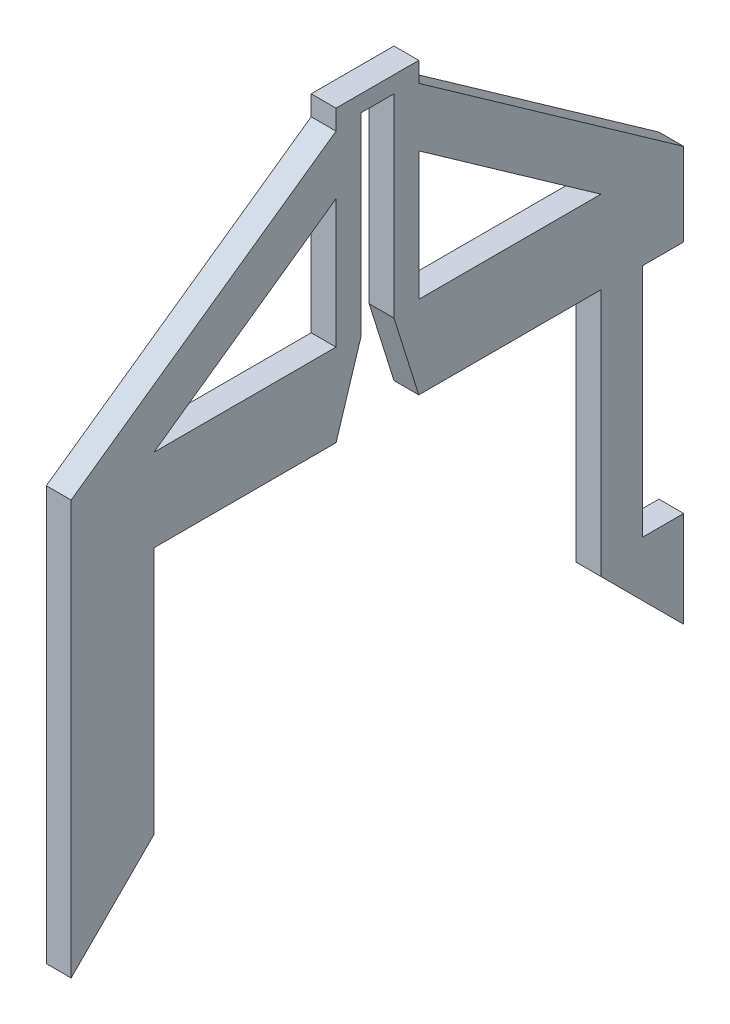
ISO-10303-21;
HEADER;
FILE_DESCRIPTION(('STEP AP214'),'2;1');
FILE_NAME('part.step','',(''),(''),'','','');
FILE_SCHEMA(('AUTOMOTIVE_DESIGN { 1 0 10303 214 1 1 1 1 }'));
ENDSEC;
DATA;
#1=APPLICATION_CONTEXT('core data for automotive mechanical design processes');
#2=APPLICATION_PROTOCOL_DEFINITION('international standard','automotive_design',2000,#1);
#3=PRODUCT_CONTEXT('',#1,'mechanical');
#4=PRODUCT('Part','Part','',(#3));
#5=PRODUCT_RELATED_PRODUCT_CATEGORY('part','',(#4));
#6=PRODUCT_DEFINITION_FORMATION('','',#4);
#7=PRODUCT_DEFINITION_CONTEXT('part definition',#1,'design');
#8=PRODUCT_DEFINITION('design','',#6,#7);
#9=PRODUCT_DEFINITION_SHAPE('','',#8);
#10=(LENGTH_UNIT() NAMED_UNIT(*) SI_UNIT(.MILLI.,.METRE.));
#11=(NAMED_UNIT(*) PLANE_ANGLE_UNIT() SI_UNIT($,.RADIAN.));
#12=(NAMED_UNIT(*) SI_UNIT($,.STERADIAN.) SOLID_ANGLE_UNIT());
#13=UNCERTAINTY_MEASURE_WITH_UNIT(LENGTH_MEASURE(1.E-05),#10,'distance_accuracy_value','');
#14=(GEOMETRIC_REPRESENTATION_CONTEXT(3) GLOBAL_UNCERTAINTY_ASSIGNED_CONTEXT((#13)) GLOBAL_UNIT_ASSIGNED_CONTEXT((#10,
#11,#12)) REPRESENTATION_CONTEXT('',''));
#15=CARTESIAN_POINT('',(0.,0.,0.));
#16=DIRECTION('',(0.,0.,1.));
#17=DIRECTION('',(1.,0.,0.));
#18=AXIS2_PLACEMENT_3D('',#15,#16,#17);
#19=CARTESIAN_POINT('',(3.,37.,-37.));
#20=DIRECTION('',(0.,0.,1.));
#21=DIRECTION('',(0.,-1.,0.));
#22=AXIS2_PLACEMENT_3D('',#19,#20,#21);
#23=PLANE('',#22);
#24=DIRECTION('',(0.,1.,0.));
#25=VECTOR('',#24,1.);
#26=CARTESIAN_POINT('',(0.,37.,-37.));
#27=LINE('',#26,#25);
#28=CARTESIAN_POINT('',(0.,-13.,-37.));
#29=VERTEX_POINT('',#28);
#30=CARTESIAN_POINT('',(0.,-1.4,-37.));
#31=VERTEX_POINT('',#30);
#32=EDGE_CURVE('E521',#29,#31,#27,.T.);
#33=ORIENTED_EDGE('',*,*,#32,.T.);
#34=DIRECTION('',(1.,0.,0.));
#35=VECTOR('',#34,1.);
#36=CARTESIAN_POINT('',(0.,-1.4,-37.));
#37=LINE('',#36,#35);
#38=CARTESIAN_POINT('',(3.,-1.4,-37.));
#39=VERTEX_POINT('',#38);
#40=EDGE_CURVE('E253',#31,#39,#37,.T.);
#41=ORIENTED_EDGE('',*,*,#40,.T.);
#42=DIRECTION('',(0.,1.,0.));
#43=VECTOR('',#42,1.);
#44=CARTESIAN_POINT('',(3.,37.,-37.));
#45=LINE('',#44,#43);
#46=CARTESIAN_POINT('',(3.,-13.,-37.));
#47=VERTEX_POINT('',#46);
#48=EDGE_CURVE('E407',#47,#39,#45,.T.);
#49=ORIENTED_EDGE('',*,*,#48,.F.);
#50=DIRECTION('',(1.,0.,0.));
#51=VECTOR('',#50,1.);
#52=CARTESIAN_POINT('',(-21.9526583780041,-13.,-37.));
#53=LINE('',#52,#51);
#54=EDGE_CURVE('E256',#29,#47,#53,.T.);
#55=ORIENTED_EDGE('',*,*,#54,.F.);
#56=EDGE_LOOP('',(#33,#41,#49,#55));
#57=FACE_BOUND('',#56,.T.);
#58=ADVANCED_FACE('F35',(#57),#23,.F.);
#59=CARTESIAN_POINT('',(3.,0.,0.));
#60=DIRECTION('',(-1.,0.,0.));
#61=DIRECTION('',(0.,0.,1.));
#62=AXIS2_PLACEMENT_3D('',#59,#60,#61);
#63=PLANE('',#62);
#64=DIRECTION('',(0.,0.576742764472841,0.816925812805683));
#65=VECTOR('',#64,1.);
#66=CARTESIAN_POINT('',(3.,37.4138213887072,-26.4138437529685));
#67=LINE('',#66,#65);
#68=CARTESIAN_POINT('',(3.,37.,-27.));
#69=VERTEX_POINT('',#68);
#70=CARTESIAN_POINT('',(3.,52.5318152756431,-4.99999999999998));
#71=VERTEX_POINT('',#70);
#72=EDGE_CURVE('E353',#69,#71,#67,.T.);
#73=ORIENTED_EDGE('',*,*,#72,.F.);
#74=DIRECTION('',(0.,0.,1.));
#75=VECTOR('',#74,1.);
#76=CARTESIAN_POINT('',(3.,37.,-37.));
#77=LINE('',#76,#75);
#78=CARTESIAN_POINT('',(3.,37.,-4.99999999999998));
#79=VERTEX_POINT('',#78);
#80=EDGE_CURVE('E401',#69,#79,#77,.T.);
#81=ORIENTED_EDGE('',*,*,#80,.T.);
#82=DIRECTION('',(0.,1.,0.));
#83=VECTOR('',#82,1.);
#84=CARTESIAN_POINT('',(3.,37.,-4.99999999999998));
#85=LINE('',#84,#83);
#86=EDGE_CURVE('E384',#79,#71,#85,.T.);
#87=ORIENTED_EDGE('',*,*,#86,.T.);
#88=EDGE_LOOP('',(#73,#81,#87));
#89=FACE_BOUND('',#88,.T.);
#90=DIRECTION('',(0.,0.576742764472841,-0.816925812805683));
#91=VECTOR('',#90,1.);
#92=CARTESIAN_POINT('',(3.,37.4138213887072,26.4138437529685));
#93=LINE('',#92,#91);
#94=CARTESIAN_POINT('',(3.,37.,27.));
#95=VERTEX_POINT('',#94);
#96=CARTESIAN_POINT('',(3.,52.5318152756431,5.00000000000002));
#97=VERTEX_POINT('',#96);
#98=EDGE_CURVE('E341',#95,#97,#93,.T.);
#99=ORIENTED_EDGE('',*,*,#98,.T.);
#100=DIRECTION('',(0.,-1.,0.));
#101=VECTOR('',#100,1.);
#102=CARTESIAN_POINT('',(3.,37.,5.00000000000002));
#103=LINE('',#102,#101);
#104=CARTESIAN_POINT('',(3.,37.,5.00000000000002));
#105=VERTEX_POINT('',#104);
#106=EDGE_CURVE('E361',#97,#105,#103,.T.);
#107=ORIENTED_EDGE('',*,*,#106,.T.);
#108=EDGE_CURVE('E403',#105,#95,#77,.T.);
#109=ORIENTED_EDGE('',*,*,#108,.T.);
#110=EDGE_LOOP('',(#99,#107,#109));
#111=FACE_BOUND('',#110,.T.);
#112=ORIENTED_EDGE('',*,*,#48,.T.);
#113=DIRECTION('',(0.,0.,-1.));
#114=VECTOR('',#113,1.);
#115=CARTESIAN_POINT('',(3.,-1.4,-37.));
#116=LINE('',#115,#114);
#117=CARTESIAN_POINT('',(3.,-1.4,-32.));
#118=VERTEX_POINT('',#117);
#119=EDGE_CURVE('E245',#118,#39,#116,.T.);
#120=ORIENTED_EDGE('',*,*,#119,.F.);
#121=DIRECTION('',(0.,-1.,0.));
#122=VECTOR('',#121,1.);
#123=CARTESIAN_POINT('',(3.,27.,-32.));
#124=LINE('',#123,#122);
#125=CARTESIAN_POINT('',(3.,27.,-32.));
#126=VERTEX_POINT('',#125);
#127=EDGE_CURVE('E247',#126,#118,#124,.T.);
#128=ORIENTED_EDGE('',*,*,#127,.F.);
#129=DIRECTION('',(0.,0.,1.));
#130=VECTOR('',#129,1.);
#131=CARTESIAN_POINT('',(3.,27.,-37.));
#132=LINE('',#131,#130);
#133=CARTESIAN_POINT('',(3.,27.,-37.));
#134=VERTEX_POINT('',#133);
#135=EDGE_CURVE('E225',#134,#126,#132,.T.);
#136=ORIENTED_EDGE('',*,*,#135,.F.);
#137=CARTESIAN_POINT('',(3.,37.,-37.));
#138=VERTEX_POINT('',#137);
#139=EDGE_CURVE('E472',#134,#138,#45,.T.);
#140=ORIENTED_EDGE('',*,*,#139,.T.);
#141=DIRECTION('',(0.,0.576757387701584,0.816915488732859));
#142=VECTOR('',#141,1.);
#143=CARTESIAN_POINT('',(3.,42.1249794824883,-29.7410117183466));
#144=LINE('',#143,#142);
#145=CARTESIAN_POINT('',(3.,59.5921320838384,-5.00064807780959));
#146=VERTEX_POINT('',#145);
#147=EDGE_CURVE('E345',#138,#146,#144,.T.);
#148=ORIENTED_EDGE('',*,*,#147,.T.);
#149=DIRECTION('',(0.,-1.,0.));
#150=VECTOR('',#149,1.);
#151=CARTESIAN_POINT('',(3.,0.,-5.00064807780959));
#152=LINE('',#151,#150);
#153=CARTESIAN_POINT('',(3.,62.0016400553734,-5.00064807780959));
#154=VERTEX_POINT('',#153);
#155=EDGE_CURVE('E279',#154,#146,#152,.T.);
#156=ORIENTED_EDGE('',*,*,#155,.F.);
#157=DIRECTION('',(0.,0.,-1.));
#158=VECTOR('',#157,1.);
#159=CARTESIAN_POINT('',(3.,62.0016400553734,0.));
#160=LINE('',#159,#158);
#161=CARTESIAN_POINT('',(3.,62.0016400553734,4.99935192219041));
#162=VERTEX_POINT('',#161);
#163=EDGE_CURVE('E278',#162,#154,#160,.T.);
#164=ORIENTED_EDGE('',*,*,#163,.F.);
#165=DIRECTION('',(0.,-1.,0.));
#166=VECTOR('',#165,1.);
#167=CARTESIAN_POINT('',(3.,0.,4.99935192219041));
#168=LINE('',#167,#166);
#169=CARTESIAN_POINT('',(3.,59.5921888475184,4.99935192219041));
#170=VERTEX_POINT('',#169);
#171=EDGE_CURVE('E276',#162,#170,#168,.T.);
#172=ORIENTED_EDGE('',*,*,#171,.T.);
#173=DIRECTION('',(0.,0.576742764472841,-0.816925812805683));
#174=VECTOR('',#173,1.);
#175=CARTESIAN_POINT('',(3.,42.1253819051749,29.7401659166862));
#176=LINE('',#175,#174);
#177=CARTESIAN_POINT('',(3.,37.,37.));
#178=VERTEX_POINT('',#177);
#179=EDGE_CURVE('E346',#178,#170,#176,.T.);
#180=ORIENTED_EDGE('',*,*,#179,.F.);
#181=DIRECTION('',(0.,-1.,0.));
#182=VECTOR('',#181,1.);
#183=CARTESIAN_POINT('',(3.,37.,37.));
#184=LINE('',#183,#182);
#185=CARTESIAN_POINT('',(3.,-13.,37.));
#186=VERTEX_POINT('',#185);
#187=EDGE_CURVE('E430',#178,#186,#184,.T.);
#188=ORIENTED_EDGE('',*,*,#187,.T.);
#189=DIRECTION('',(0.,-0.707106781186548,0.707106781186548));
#190=VECTOR('',#189,1.);
#191=CARTESIAN_POINT('',(3.,12.,12.));
#192=LINE('',#191,#190);
#193=CARTESIAN_POINT('',(3.,-3.,27.));
#194=VERTEX_POINT('',#193);
#195=EDGE_CURVE('E263',#194,#186,#192,.T.);
#196=ORIENTED_EDGE('',*,*,#195,.F.);
#197=DIRECTION('',(0.,-1.,0.));
#198=VECTOR('',#197,1.);
#199=CARTESIAN_POINT('',(3.,27.,27.));
#200=LINE('',#199,#198);
#201=CARTESIAN_POINT('',(3.,27.,27.));
#202=VERTEX_POINT('',#201);
#203=EDGE_CURVE('E487',#202,#194,#200,.T.);
#204=ORIENTED_EDGE('',*,*,#203,.F.);
#205=DIRECTION('',(0.,0.,1.));
#206=VECTOR('',#205,1.);
#207=CARTESIAN_POINT('',(3.,27.,27.));
#208=LINE('',#207,#206);
#209=CARTESIAN_POINT('',(3.,27.,4.99441269202026));
#210=VERTEX_POINT('',#209);
#211=EDGE_CURVE('E501',#210,#202,#208,.T.);
#212=ORIENTED_EDGE('',*,*,#211,.F.);
#213=DIRECTION('',(0.,0.95409439252637,-0.299506076982984));
#214=VECTOR('',#213,1.);
#215=CARTESIAN_POINT('',(3.,3.84919376417856,12.2618352961128));
#216=LINE('',#215,#214);
#217=CARTESIAN_POINT('',(3.,36.5409439252637,1.99935192219042));
#218=VERTEX_POINT('',#217);
#219=EDGE_CURVE('E309',#210,#218,#216,.T.);
#220=ORIENTED_EDGE('',*,*,#219,.T.);
#221=DIRECTION('',(0.,-1.,0.));
#222=VECTOR('',#221,1.);
#223=CARTESIAN_POINT('',(3.,0.,1.99935192219041));
#224=LINE('',#223,#222);
#225=CARTESIAN_POINT('',(3.,60.0016400553734,1.99935192219042));
#226=VERTEX_POINT('',#225);
#227=EDGE_CURVE('E312',#226,#218,#224,.T.);
#228=ORIENTED_EDGE('',*,*,#227,.F.);
#229=DIRECTION('',(0.,0.,-1.));
#230=VECTOR('',#229,1.);
#231=CARTESIAN_POINT('',(3.,60.0016400553734,1.04086253601167E-13));
#232=LINE('',#231,#230);
#233=CARTESIAN_POINT('',(3.,60.0016400553734,-2.00064807780958));
#234=VERTEX_POINT('',#233);
#235=EDGE_CURVE('E300',#226,#234,#232,.T.);
#236=ORIENTED_EDGE('',*,*,#235,.T.);
#237=DIRECTION('',(0.,1.,0.));
#238=VECTOR('',#237,1.);
#239=CARTESIAN_POINT('',(3.,0.,-2.00064807780958));
#240=LINE('',#239,#238);
#241=CARTESIAN_POINT('',(3.,36.5393920141694,-2.00064807780958));
#242=VERTEX_POINT('',#241);
#243=EDGE_CURVE('E303',#242,#234,#240,.T.);
#244=ORIENTED_EDGE('',*,*,#243,.F.);
#245=DIRECTION('',(0.,-0.953939201416946,-0.3));
#246=VECTOR('',#245,1.);
#247=CARTESIAN_POINT('',(3.,3.86109427017386,-12.277497282284));
#248=LINE('',#247,#246);
#249=CARTESIAN_POINT('',(3.,27.,-5.00064807780958));
#250=VERTEX_POINT('',#249);
#251=EDGE_CURVE('E306',#242,#250,#248,.T.);
#252=ORIENTED_EDGE('',*,*,#251,.T.);
#253=CARTESIAN_POINT('',(3.,27.,-27.));
#254=VERTEX_POINT('',#253);
#255=EDGE_CURVE('E499',#254,#250,#208,.T.);
#256=ORIENTED_EDGE('',*,*,#255,.F.);
#257=DIRECTION('',(0.,1.,0.));
#258=VECTOR('',#257,1.);
#259=CARTESIAN_POINT('',(3.,27.,-27.));
#260=LINE('',#259,#258);
#261=CARTESIAN_POINT('',(3.,-3.,-27.));
#262=VERTEX_POINT('',#261);
#263=EDGE_CURVE('E491',#262,#254,#260,.T.);
#264=ORIENTED_EDGE('',*,*,#263,.F.);
#265=DIRECTION('',(0.,-0.707106781186548,-0.707106781186547));
#266=VECTOR('',#265,1.);
#267=CARTESIAN_POINT('',(3.,12.,-12.));
#268=LINE('',#267,#266);
#269=EDGE_CURVE('E61',#262,#47,#268,.T.);
#270=ORIENTED_EDGE('',*,*,#269,.T.);
#271=EDGE_LOOP('',(#112,#120,#128,#136,#140,#148,#156,#164,#172,#180,#188,#196,#204,#212,#220,
#228,#236,#244,#252,#256,#264,#270));
#272=FACE_BOUND('',#271,.T.);
#273=ADVANCED_FACE('F420',(#89,#111,#272),#63,.F.);
#274=CARTESIAN_POINT('',(0.,0.,0.));
#275=DIRECTION('',(-1.,0.,0.));
#276=DIRECTION('',(0.,0.,1.));
#277=AXIS2_PLACEMENT_3D('',#274,#275,#276);
#278=PLANE('',#277);
#279=DIRECTION('',(0.,0.,-1.));
#280=VECTOR('',#279,1.);
#281=CARTESIAN_POINT('',(0.,-1.4,-37.));
#282=LINE('',#281,#280);
#283=CARTESIAN_POINT('',(0.,-1.4,-32.));
#284=VERTEX_POINT('',#283);
#285=EDGE_CURVE('E238',#284,#31,#282,.T.);
#286=ORIENTED_EDGE('',*,*,#285,.T.);
#287=ORIENTED_EDGE('',*,*,#32,.F.);
#288=DIRECTION('',(0.,-0.707106781186548,-0.707106781186548));
#289=VECTOR('',#288,1.);
#290=CARTESIAN_POINT('',(0.,12.,-12.));
#291=LINE('',#290,#289);
#292=CARTESIAN_POINT('',(0.,-3.,-27.));
#293=VERTEX_POINT('',#292);
#294=EDGE_CURVE('E260',#293,#29,#291,.T.);
#295=ORIENTED_EDGE('',*,*,#294,.F.);
#296=DIRECTION('',(0.,1.,0.));
#297=VECTOR('',#296,1.);
#298=CARTESIAN_POINT('',(0.,27.,-27.));
#299=LINE('',#298,#297);
#300=CARTESIAN_POINT('',(0.,27.,-27.));
#301=VERTEX_POINT('',#300);
#302=EDGE_CURVE('E395',#293,#301,#299,.T.);
#303=ORIENTED_EDGE('',*,*,#302,.T.);
#304=DIRECTION('',(0.,0.,1.));
#305=VECTOR('',#304,1.);
#306=CARTESIAN_POINT('',(0.,27.,27.));
#307=LINE('',#306,#305);
#308=CARTESIAN_POINT('',(0.,27.,-5.00064807780958));
#309=VERTEX_POINT('',#308);
#310=EDGE_CURVE('E492',#301,#309,#307,.T.);
#311=ORIENTED_EDGE('',*,*,#310,.T.);
#312=DIRECTION('',(0.,0.953939201416946,0.3));
#313=VECTOR('',#312,1.);
#314=CARTESIAN_POINT('',(0.,3.86109427017386,-12.277497282284));
#315=LINE('',#314,#313);
#316=CARTESIAN_POINT('',(0.,36.5393920141694,-2.00064807780958));
#317=VERTEX_POINT('',#316);
#318=EDGE_CURVE('E322',#309,#317,#315,.T.);
#319=ORIENTED_EDGE('',*,*,#318,.T.);
#320=DIRECTION('',(0.,-1.,0.));
#321=VECTOR('',#320,1.);
#322=CARTESIAN_POINT('',(0.,0.,-2.00064807780958));
#323=LINE('',#322,#321);
#324=CARTESIAN_POINT('',(0.,60.0016400553734,-2.00064807780958));
#325=VERTEX_POINT('',#324);
#326=EDGE_CURVE('E320',#325,#317,#323,.T.);
#327=ORIENTED_EDGE('',*,*,#326,.F.);
#328=DIRECTION('',(0.,0.,1.));
#329=VECTOR('',#328,1.);
#330=CARTESIAN_POINT('',(0.,60.0016400553734,1.04086253601167E-13));
#331=LINE('',#330,#329);
#332=CARTESIAN_POINT('',(0.,60.0016400553734,1.99935192219042));
#333=VERTEX_POINT('',#332);
#334=EDGE_CURVE('E317',#325,#333,#331,.T.);
#335=ORIENTED_EDGE('',*,*,#334,.T.);
#336=DIRECTION('',(0.,1.,0.));
#337=VECTOR('',#336,1.);
#338=CARTESIAN_POINT('',(0.,0.,1.99935192219041));
#339=LINE('',#338,#337);
#340=CARTESIAN_POINT('',(0.,36.5409439252637,1.99935192219042));
#341=VERTEX_POINT('',#340);
#342=EDGE_CURVE('E315',#341,#333,#339,.T.);
#343=ORIENTED_EDGE('',*,*,#342,.F.);
#344=DIRECTION('',(0.,-0.95409439252637,0.299506076982984));
#345=VECTOR('',#344,1.);
#346=CARTESIAN_POINT('',(0.,3.84919376417856,12.2618352961128));
#347=LINE('',#346,#345);
#348=CARTESIAN_POINT('',(0.,27.,4.99441269202026));
#349=VERTEX_POINT('',#348);
#350=EDGE_CURVE('E281',#341,#349,#347,.T.);
#351=ORIENTED_EDGE('',*,*,#350,.T.);
#352=CARTESIAN_POINT('',(0.,27.,27.));
#353=VERTEX_POINT('',#352);
#354=EDGE_CURVE('E495',#349,#353,#307,.T.);
#355=ORIENTED_EDGE('',*,*,#354,.T.);
#356=DIRECTION('',(0.,-1.,0.));
#357=VECTOR('',#356,1.);
#358=CARTESIAN_POINT('',(0.,27.,27.));
#359=LINE('',#358,#357);
#360=CARTESIAN_POINT('',(0.,-3.,27.));
#361=VERTEX_POINT('',#360);
#362=EDGE_CURVE('E488',#353,#361,#359,.T.);
#363=ORIENTED_EDGE('',*,*,#362,.T.);
#364=DIRECTION('',(0.,-0.707106781186548,0.707106781186548));
#365=VECTOR('',#364,1.);
#366=CARTESIAN_POINT('',(0.,12.,12.));
#367=LINE('',#366,#365);
#368=CARTESIAN_POINT('',(0.,-13.,37.));
#369=VERTEX_POINT('',#368);
#370=EDGE_CURVE('E268',#361,#369,#367,.T.);
#371=ORIENTED_EDGE('',*,*,#370,.T.);
#372=DIRECTION('',(0.,-1.,0.));
#373=VECTOR('',#372,1.);
#374=CARTESIAN_POINT('',(0.,37.,37.));
#375=LINE('',#374,#373);
#376=CARTESIAN_POINT('',(0.,37.,37.));
#377=VERTEX_POINT('',#376);
#378=EDGE_CURVE('E409',#377,#369,#375,.T.);
#379=ORIENTED_EDGE('',*,*,#378,.F.);
#380=DIRECTION('',(0.,0.576742764472841,-0.816925812805683));
#381=VECTOR('',#380,1.);
#382=CARTESIAN_POINT('',(0.,42.1253819051749,29.7401659166862));
#383=LINE('',#382,#381);
#384=CARTESIAN_POINT('',(0.,59.5921888475184,4.99935192219041));
#385=VERTEX_POINT('',#384);
#386=EDGE_CURVE('E358',#377,#385,#383,.T.);
#387=ORIENTED_EDGE('',*,*,#386,.T.);
#388=DIRECTION('',(0.,1.,0.));
#389=VECTOR('',#388,1.);
#390=CARTESIAN_POINT('',(0.,0.,4.99935192219041));
#391=LINE('',#390,#389);
#392=CARTESIAN_POINT('',(0.,62.0016400553734,4.99935192219041));
#393=VERTEX_POINT('',#392);
#394=EDGE_CURVE('E286',#385,#393,#391,.T.);
#395=ORIENTED_EDGE('',*,*,#394,.T.);
#396=DIRECTION('',(0.,0.,1.));
#397=VECTOR('',#396,1.);
#398=CARTESIAN_POINT('',(0.,62.0016400553734,0.));
#399=LINE('',#398,#397);
#400=CARTESIAN_POINT('',(0.,62.0016400553734,-5.00064807780959));
#401=VERTEX_POINT('',#400);
#402=EDGE_CURVE('E275',#401,#393,#399,.T.);
#403=ORIENTED_EDGE('',*,*,#402,.F.);
#404=DIRECTION('',(0.,1.,0.));
#405=VECTOR('',#404,1.);
#406=CARTESIAN_POINT('',(0.,0.,-5.00064807780959));
#407=LINE('',#406,#405);
#408=CARTESIAN_POINT('',(0.,59.5921320838384,-5.00064807780959));
#409=VERTEX_POINT('',#408);
#410=EDGE_CURVE('E283',#409,#401,#407,.T.);
#411=ORIENTED_EDGE('',*,*,#410,.F.);
#412=DIRECTION('',(0.,0.576757387701584,0.816915488732859));
#413=VECTOR('',#412,1.);
#414=CARTESIAN_POINT('',(0.,42.1249794824883,-29.7410117183466));
#415=LINE('',#414,#413);
#416=CARTESIAN_POINT('',(0.,37.,-37.));
#417=VERTEX_POINT('',#416);
#418=EDGE_CURVE('E349',#417,#409,#415,.T.);
#419=ORIENTED_EDGE('',*,*,#418,.F.);
#420=CARTESIAN_POINT('',(0.,27.,-37.));
#421=VERTEX_POINT('',#420);
#422=EDGE_CURVE('E244',#421,#417,#27,.T.);
#423=ORIENTED_EDGE('',*,*,#422,.F.);
#424=DIRECTION('',(0.,0.,1.));
#425=VECTOR('',#424,1.);
#426=CARTESIAN_POINT('',(0.,27.,-37.));
#427=LINE('',#426,#425);
#428=CARTESIAN_POINT('',(0.,27.,-32.));
#429=VERTEX_POINT('',#428);
#430=EDGE_CURVE('E53',#421,#429,#427,.T.);
#431=ORIENTED_EDGE('',*,*,#430,.T.);
#432=DIRECTION('',(0.,-1.,0.));
#433=VECTOR('',#432,1.);
#434=CARTESIAN_POINT('',(0.,27.,-32.));
#435=LINE('',#434,#433);
#436=EDGE_CURVE('E233',#429,#284,#435,.T.);
#437=ORIENTED_EDGE('',*,*,#436,.T.);
#438=EDGE_LOOP('',(#286,#287,#295,#303,#311,#319,#327,#335,#343,#351,#355,#363,#371,#379,#387,
#395,#403,#411,#419,#423,#431,#437));
#439=FACE_BOUND('',#438,.T.);
#440=DIRECTION('',(0.,0.,1.));
#441=VECTOR('',#440,1.);
#442=CARTESIAN_POINT('',(0.,37.,-37.));
#443=LINE('',#442,#441);
#444=CARTESIAN_POINT('',(0.,37.,-27.));
#445=VERTEX_POINT('',#444);
#446=CARTESIAN_POINT('',(0.,37.,-4.99999999999998));
#447=VERTEX_POINT('',#446);
#448=EDGE_CURVE('E398',#445,#447,#443,.T.);
#449=ORIENTED_EDGE('',*,*,#448,.F.);
#450=DIRECTION('',(0.,0.576742764472841,0.816925812805683));
#451=VECTOR('',#450,1.);
#452=CARTESIAN_POINT('',(0.,37.4138213887072,-26.4138437529685));
#453=LINE('',#452,#451);
#454=CARTESIAN_POINT('',(0.,52.5318152756431,-4.99999999999998));
#455=VERTEX_POINT('',#454);
#456=EDGE_CURVE('E344',#445,#455,#453,.T.);
#457=ORIENTED_EDGE('',*,*,#456,.T.);
#458=DIRECTION('',(0.,1.,0.));
#459=VECTOR('',#458,1.);
#460=CARTESIAN_POINT('',(0.,37.,-4.99999999999998));
#461=LINE('',#460,#459);
#462=EDGE_CURVE('E383',#447,#455,#461,.T.);
#463=ORIENTED_EDGE('',*,*,#462,.F.);
#464=EDGE_LOOP('',(#449,#457,#463));
#465=FACE_BOUND('',#464,.T.);
#466=DIRECTION('',(0.,-1.,0.));
#467=VECTOR('',#466,1.);
#468=CARTESIAN_POINT('',(0.,37.,5.00000000000002));
#469=LINE('',#468,#467);
#470=CARTESIAN_POINT('',(0.,52.5318152756431,5.00000000000002));
#471=VERTEX_POINT('',#470);
#472=CARTESIAN_POINT('',(0.,37.,5.00000000000002));
#473=VERTEX_POINT('',#472);
#474=EDGE_CURVE('E39',#471,#473,#469,.T.);
#475=ORIENTED_EDGE('',*,*,#474,.F.);
#476=DIRECTION('',(0.,0.576742764472841,-0.816925812805683));
#477=VECTOR('',#476,1.);
#478=CARTESIAN_POINT('',(0.,37.4138213887072,26.4138437529685));
#479=LINE('',#478,#477);
#480=CARTESIAN_POINT('',(0.,37.,27.));
#481=VERTEX_POINT('',#480);
#482=EDGE_CURVE('E362',#481,#471,#479,.T.);
#483=ORIENTED_EDGE('',*,*,#482,.F.);
#484=EDGE_CURVE('E415',#473,#481,#443,.T.);
#485=ORIENTED_EDGE('',*,*,#484,.F.);
#486=EDGE_LOOP('',(#475,#483,#485));
#487=FACE_BOUND('',#486,.T.);
#488=ADVANCED_FACE('F241',(#439,#465,#487),#278,.T.);
#489=ORIENTED_EDGE('',*,*,#139,.F.);
#490=DIRECTION('',(1.,0.,0.));
#491=VECTOR('',#490,1.);
#492=CARTESIAN_POINT('',(0.,27.,-37.));
#493=LINE('',#492,#491);
#494=EDGE_CURVE('E230',#421,#134,#493,.T.);
#495=ORIENTED_EDGE('',*,*,#494,.F.);
#496=ORIENTED_EDGE('',*,*,#422,.T.);
#497=DIRECTION('',(-1.,0.,0.));
#498=VECTOR('',#497,1.);
#499=CARTESIAN_POINT('',(3.,37.,-37.));
#500=LINE('',#499,#498);
#501=EDGE_CURVE('E11',#138,#417,#500,.T.);
#502=ORIENTED_EDGE('',*,*,#501,.F.);
#503=EDGE_LOOP('',(#489,#495,#496,#502));
#504=FACE_BOUND('',#503,.T.);
#505=ADVANCED_FACE('F451',(#504),#23,.F.);
#506=CARTESIAN_POINT('',(3.,27.,-27.));
#507=DIRECTION('',(0.,0.,1.));
#508=DIRECTION('',(0.,-1.,0.));
#509=AXIS2_PLACEMENT_3D('',#506,#507,#508);
#510=PLANE('',#509);
#511=ORIENTED_EDGE('',*,*,#302,.F.);
#512=DIRECTION('',(1.,0.,0.));
#513=VECTOR('',#512,1.);
#514=CARTESIAN_POINT('',(-21.9526583780041,-3.,-27.));
#515=LINE('',#514,#513);
#516=EDGE_CURVE('E261',#293,#262,#515,.T.);
#517=ORIENTED_EDGE('',*,*,#516,.T.);
#518=ORIENTED_EDGE('',*,*,#263,.T.);
#519=DIRECTION('',(-1.,0.,0.));
#520=VECTOR('',#519,1.);
#521=CARTESIAN_POINT('',(3.,27.,-27.));
#522=LINE('',#521,#520);
#523=EDGE_CURVE('E481',#254,#301,#522,.T.);
#524=ORIENTED_EDGE('',*,*,#523,.T.);
#525=EDGE_LOOP('',(#511,#517,#518,#524));
#526=FACE_BOUND('',#525,.T.);
#527=ADVANCED_FACE('F459',(#526),#510,.T.);
#528=CARTESIAN_POINT('',(-78.4752736684447,42.1249794824883,-29.7410117183466));
#529=DIRECTION('',(0.,0.816915488732858,-0.576757387701584));
#530=DIRECTION('',(0.,0.576757387701584,0.816915488732859));
#531=AXIS2_PLACEMENT_3D('',#528,#529,#530);
#532=PLANE('',#531);
#533=ORIENTED_EDGE('',*,*,#418,.T.);
#534=DIRECTION('',(-1.,0.,0.));
#535=VECTOR('',#534,1.);
#536=CARTESIAN_POINT('',(16.8501175789074,59.5921320838384,-5.00064807780959));
#537=LINE('',#536,#535);
#538=EDGE_CURVE('E296',#146,#409,#537,.T.);
#539=ORIENTED_EDGE('',*,*,#538,.F.);
#540=ORIENTED_EDGE('',*,*,#147,.F.);
#541=ORIENTED_EDGE('',*,*,#501,.T.);
#542=EDGE_LOOP('',(#533,#539,#540,#541));
#543=FACE_BOUND('',#542,.T.);
#544=ADVANCED_FACE('F466',(#543),#532,.T.);
#545=CARTESIAN_POINT('',(3.,27.,27.));
#546=DIRECTION('',(0.,-1.,0.));
#547=DIRECTION('',(0.,0.,-1.));
#548=AXIS2_PLACEMENT_3D('',#545,#546,#547);
#549=PLANE('',#548);
#550=ORIENTED_EDGE('',*,*,#354,.F.);
#551=DIRECTION('',(-1.,0.,0.));
#552=VECTOR('',#551,1.);
#553=CARTESIAN_POINT('',(37.4820168513534,27.,4.99441269202026));
#554=LINE('',#553,#552);
#555=EDGE_CURVE('E304',#210,#349,#554,.T.);
#556=ORIENTED_EDGE('',*,*,#555,.F.);
#557=ORIENTED_EDGE('',*,*,#211,.T.);
#558=DIRECTION('',(-1.,0.,0.));
#559=VECTOR('',#558,1.);
#560=CARTESIAN_POINT('',(3.,27.,27.));
#561=LINE('',#560,#559);
#562=EDGE_CURVE('E484',#202,#353,#561,.T.);
#563=ORIENTED_EDGE('',*,*,#562,.T.);
#564=EDGE_LOOP('',(#550,#556,#557,#563));
#565=FACE_BOUND('',#564,.T.);
#566=ADVANCED_FACE('F509',(#565),#549,.T.);
#567=ORIENTED_EDGE('',*,*,#255,.T.);
#568=DIRECTION('',(-1.,0.,0.));
#569=VECTOR('',#568,1.);
#570=CARTESIAN_POINT('',(37.4820168513534,27.,-5.00064807780958));
#571=LINE('',#570,#569);
#572=EDGE_CURVE('E327',#250,#309,#571,.T.);
#573=ORIENTED_EDGE('',*,*,#572,.T.);
#574=ORIENTED_EDGE('',*,*,#310,.F.);
#575=ORIENTED_EDGE('',*,*,#523,.F.);
#576=EDGE_LOOP('',(#567,#573,#574,#575));
#577=FACE_BOUND('',#576,.T.);
#578=ADVANCED_FACE('F545',(#577),#549,.T.);
#579=CARTESIAN_POINT('',(3.,37.,37.));
#580=DIRECTION('',(0.,0.,-1.));
#581=DIRECTION('',(0.,1.,0.));
#582=AXIS2_PLACEMENT_3D('',#579,#580,#581);
#583=PLANE('',#582);
#584=ORIENTED_EDGE('',*,*,#378,.T.);
#585=DIRECTION('',(1.,0.,0.));
#586=VECTOR('',#585,1.);
#587=CARTESIAN_POINT('',(-21.9526583780041,-13.,37.));
#588=LINE('',#587,#586);
#589=EDGE_CURVE('E271',#369,#186,#588,.T.);
#590=ORIENTED_EDGE('',*,*,#589,.T.);
#591=ORIENTED_EDGE('',*,*,#187,.F.);
#592=DIRECTION('',(-1.,0.,0.));
#593=VECTOR('',#592,1.);
#594=CARTESIAN_POINT('',(3.,37.,37.));
#595=LINE('',#594,#593);
#596=EDGE_CURVE('E45',#178,#377,#595,.T.);
#597=ORIENTED_EDGE('',*,*,#596,.T.);
#598=EDGE_LOOP('',(#584,#590,#591,#597));
#599=FACE_BOUND('',#598,.T.);
#600=ADVANCED_FACE('F37',(#599),#583,.F.);
#601=CARTESIAN_POINT('',(3.,27.,27.));
#602=DIRECTION('',(0.,0.,-1.));
#603=DIRECTION('',(0.,1.,0.));
#604=AXIS2_PLACEMENT_3D('',#601,#602,#603);
#605=PLANE('',#604);
#606=DIRECTION('',(1.,0.,0.));
#607=VECTOR('',#606,1.);
#608=CARTESIAN_POINT('',(-21.9526583780041,-3.,27.));
#609=LINE('',#608,#607);
#610=EDGE_CURVE('E267',#361,#194,#609,.T.);
#611=ORIENTED_EDGE('',*,*,#610,.F.);
#612=ORIENTED_EDGE('',*,*,#362,.F.);
#613=ORIENTED_EDGE('',*,*,#562,.F.);
#614=ORIENTED_EDGE('',*,*,#203,.T.);
#615=EDGE_LOOP('',(#611,#612,#613,#614));
#616=FACE_BOUND('',#615,.T.);
#617=ADVANCED_FACE('F514',(#616),#605,.T.);
#618=CARTESIAN_POINT('',(3.,37.,-37.));
#619=DIRECTION('',(0.,-1.,0.));
#620=DIRECTION('',(0.,0.,-1.));
#621=AXIS2_PLACEMENT_3D('',#618,#619,#620);
#622=PLANE('',#621);
#623=DIRECTION('',(1.,0.,0.));
#624=VECTOR('',#623,1.);
#625=CARTESIAN_POINT('',(-78.4752736684447,37.,-27.));
#626=LINE('',#625,#624);
#627=EDGE_CURVE('E340',#445,#69,#626,.T.);
#628=ORIENTED_EDGE('',*,*,#627,.F.);
#629=ORIENTED_EDGE('',*,*,#448,.T.);
#630=DIRECTION('',(1.,0.,0.));
#631=VECTOR('',#630,1.);
#632=CARTESIAN_POINT('',(-26.9258240356725,37.,-4.99999999999998));
#633=LINE('',#632,#631);
#634=EDGE_CURVE('E379',#447,#79,#633,.T.);
#635=ORIENTED_EDGE('',*,*,#634,.T.);
#636=ORIENTED_EDGE('',*,*,#80,.F.);
#637=EDGE_LOOP('',(#628,#629,#635,#636));
#638=FACE_BOUND('',#637,.T.);
#639=ADVANCED_FACE('F427',(#638),#622,.F.);
#640=CARTESIAN_POINT('',(-26.9258240356725,37.,-4.99999999999998));
#641=DIRECTION('',(0.,0.,-1.));
#642=DIRECTION('',(-1.,0.,0.));
#643=AXIS2_PLACEMENT_3D('',#640,#641,#642);
#644=PLANE('',#643);
#645=ORIENTED_EDGE('',*,*,#462,.T.);
#646=DIRECTION('',(1.,0.,0.));
#647=VECTOR('',#646,1.);
#648=CARTESIAN_POINT('',(-78.4752736684447,52.5318152756431,-4.99999999999998));
#649=LINE('',#648,#647);
#650=EDGE_CURVE('E355',#455,#71,#649,.T.);
#651=ORIENTED_EDGE('',*,*,#650,.T.);
#652=ORIENTED_EDGE('',*,*,#86,.F.);
#653=ORIENTED_EDGE('',*,*,#634,.F.);
#654=EDGE_LOOP('',(#645,#651,#652,#653));
#655=FACE_BOUND('',#654,.T.);
#656=ADVANCED_FACE('F424',(#655),#644,.T.);
#657=CARTESIAN_POINT('',(-26.9258240356725,37.,5.00000000000002));
#658=DIRECTION('',(0.,0.,1.));
#659=DIRECTION('',(1.,0.,0.));
#660=AXIS2_PLACEMENT_3D('',#657,#658,#659);
#661=PLANE('',#660);
#662=DIRECTION('',(1.,0.,0.));
#663=VECTOR('',#662,1.);
#664=CARTESIAN_POINT('',(-78.4752736684447,52.5318152756431,5.00000000000002));
#665=LINE('',#664,#663);
#666=EDGE_CURVE('E364',#471,#97,#665,.T.);
#667=ORIENTED_EDGE('',*,*,#666,.F.);
#668=ORIENTED_EDGE('',*,*,#474,.T.);
#669=DIRECTION('',(1.,0.,0.));
#670=VECTOR('',#669,1.);
#671=CARTESIAN_POINT('',(-26.9258240356725,37.,5.00000000000002));
#672=LINE('',#671,#670);
#673=EDGE_CURVE('E392',#473,#105,#672,.T.);
#674=ORIENTED_EDGE('',*,*,#673,.T.);
#675=ORIENTED_EDGE('',*,*,#106,.F.);
#676=EDGE_LOOP('',(#667,#668,#674,#675));
#677=FACE_BOUND('',#676,.T.);
#678=ADVANCED_FACE('F445',(#677),#661,.T.);
#679=ORIENTED_EDGE('',*,*,#484,.T.);
#680=DIRECTION('',(1.,0.,0.));
#681=VECTOR('',#680,1.);
#682=CARTESIAN_POINT('',(-78.4752736684447,37.,27.));
#683=LINE('',#682,#681);
#684=EDGE_CURVE('E350',#481,#95,#683,.T.);
#685=ORIENTED_EDGE('',*,*,#684,.T.);
#686=ORIENTED_EDGE('',*,*,#108,.F.);
#687=ORIENTED_EDGE('',*,*,#673,.F.);
#688=EDGE_LOOP('',(#679,#685,#686,#687));
#689=FACE_BOUND('',#688,.T.);
#690=ADVANCED_FACE('F436',(#689),#622,.F.);
#691=CARTESIAN_POINT('',(-78.4752736684447,37.4138213887072,-26.4138437529685));
#692=DIRECTION('',(0.,0.816925812805683,-0.576742764472841));
#693=DIRECTION('',(0.,0.576742764472841,0.816925812805683));
#694=AXIS2_PLACEMENT_3D('',#691,#692,#693);
#695=PLANE('',#694);
#696=ORIENTED_EDGE('',*,*,#456,.F.);
#697=ORIENTED_EDGE('',*,*,#627,.T.);
#698=ORIENTED_EDGE('',*,*,#72,.T.);
#699=ORIENTED_EDGE('',*,*,#650,.F.);
#700=EDGE_LOOP('',(#696,#697,#698,#699));
#701=FACE_BOUND('',#700,.T.);
#702=ADVANCED_FACE('F433',(#701),#695,.F.);
#703=CARTESIAN_POINT('',(-78.4752736684447,37.4138213887072,26.4138437529685));
#704=DIRECTION('',(0.,-0.816925812805683,-0.576742764472841));
#705=DIRECTION('',(0.,0.576742764472841,-0.816925812805683));
#706=AXIS2_PLACEMENT_3D('',#703,#704,#705);
#707=PLANE('',#706);
#708=ORIENTED_EDGE('',*,*,#684,.F.);
#709=ORIENTED_EDGE('',*,*,#482,.T.);
#710=ORIENTED_EDGE('',*,*,#666,.T.);
#711=ORIENTED_EDGE('',*,*,#98,.F.);
#712=EDGE_LOOP('',(#708,#709,#710,#711));
#713=FACE_BOUND('',#712,.T.);
#714=ADVANCED_FACE('F435',(#713),#707,.T.);
#715=CARTESIAN_POINT('',(-78.4752736684447,42.1253819051749,29.7401659166862));
#716=DIRECTION('',(0.,-0.816925812805683,-0.576742764472841));
#717=DIRECTION('',(0.,0.576742764472841,-0.816925812805683));
#718=AXIS2_PLACEMENT_3D('',#715,#716,#717);
#719=PLANE('',#718);
#720=ORIENTED_EDGE('',*,*,#179,.T.);
#721=DIRECTION('',(-1.,0.,0.));
#722=VECTOR('',#721,1.);
#723=CARTESIAN_POINT('',(16.8501175789074,59.5921888475184,4.99935192219041));
#724=LINE('',#723,#722);
#725=EDGE_CURVE('E293',#170,#385,#724,.T.);
#726=ORIENTED_EDGE('',*,*,#725,.T.);
#727=ORIENTED_EDGE('',*,*,#386,.F.);
#728=ORIENTED_EDGE('',*,*,#596,.F.);
#729=EDGE_LOOP('',(#720,#726,#727,#728));
#730=FACE_BOUND('',#729,.T.);
#731=ADVANCED_FACE('F442',(#730),#719,.F.);
#732=CARTESIAN_POINT('',(37.4820168513534,3.84919376417856,12.2618352961128));
#733=DIRECTION('',(0.,-0.299506076982984,-0.95409439252637));
#734=DIRECTION('',(0.,0.95409439252637,-0.299506076982984));
#735=AXIS2_PLACEMENT_3D('',#732,#733,#734);
#736=PLANE('',#735);
#737=ORIENTED_EDGE('',*,*,#555,.T.);
#738=ORIENTED_EDGE('',*,*,#350,.F.);
#739=DIRECTION('',(-1.,0.,0.));
#740=VECTOR('',#739,1.);
#741=CARTESIAN_POINT('',(37.4820168513534,36.5409439252637,1.99935192219042));
#742=LINE('',#741,#740);
#743=EDGE_CURVE('E325',#218,#341,#742,.T.);
#744=ORIENTED_EDGE('',*,*,#743,.F.);
#745=ORIENTED_EDGE('',*,*,#219,.F.);
#746=EDGE_LOOP('',(#737,#738,#744,#745));
#747=FACE_BOUND('',#746,.T.);
#748=ADVANCED_FACE('F600',(#747),#736,.T.);
#749=CARTESIAN_POINT('',(37.4820168513534,3.86109427017386,-12.277497282284));
#750=DIRECTION('',(0.,-0.3,0.953939201416946));
#751=DIRECTION('',(0.,-0.953939201416946,-0.3));
#752=AXIS2_PLACEMENT_3D('',#749,#750,#751);
#753=PLANE('',#752);
#754=DIRECTION('',(-1.,0.,0.));
#755=VECTOR('',#754,1.);
#756=CARTESIAN_POINT('',(37.4820168513534,36.5393920141694,-2.00064807780958));
#757=LINE('',#756,#755);
#758=EDGE_CURVE('E330',#242,#317,#757,.T.);
#759=ORIENTED_EDGE('',*,*,#758,.T.);
#760=ORIENTED_EDGE('',*,*,#318,.F.);
#761=ORIENTED_EDGE('',*,*,#572,.F.);
#762=ORIENTED_EDGE('',*,*,#251,.F.);
#763=EDGE_LOOP('',(#759,#760,#761,#762));
#764=FACE_BOUND('',#763,.T.);
#765=ADVANCED_FACE('F604',(#764),#753,.T.);
#766=CARTESIAN_POINT('',(37.4820168513534,0.,-2.00064807780958));
#767=DIRECTION('',(0.,0.,-1.));
#768=DIRECTION('',(0.,1.,0.));
#769=AXIS2_PLACEMENT_3D('',#766,#767,#768);
#770=PLANE('',#769);
#771=ORIENTED_EDGE('',*,*,#243,.T.);
#772=DIRECTION('',(-1.,0.,0.));
#773=VECTOR('',#772,1.);
#774=CARTESIAN_POINT('',(37.4820168513534,60.0016400553734,-2.00064807780958));
#775=LINE('',#774,#773);
#776=EDGE_CURVE('E333',#234,#325,#775,.T.);
#777=ORIENTED_EDGE('',*,*,#776,.T.);
#778=ORIENTED_EDGE('',*,*,#326,.T.);
#779=ORIENTED_EDGE('',*,*,#758,.F.);
#780=EDGE_LOOP('',(#771,#777,#778,#779));
#781=FACE_BOUND('',#780,.T.);
#782=ADVANCED_FACE('F614',(#781),#770,.F.);
#783=CARTESIAN_POINT('',(37.4820168513534,60.0016400553734,1.04086253601167E-13));
#784=DIRECTION('',(0.,-1.,0.));
#785=DIRECTION('',(0.,0.,-1.));
#786=AXIS2_PLACEMENT_3D('',#783,#784,#785);
#787=PLANE('',#786);
#788=DIRECTION('',(-1.,0.,0.));
#789=VECTOR('',#788,1.);
#790=CARTESIAN_POINT('',(37.4820168513534,60.0016400553734,1.99935192219042));
#791=LINE('',#790,#789);
#792=EDGE_CURVE('E335',#226,#333,#791,.T.);
#793=ORIENTED_EDGE('',*,*,#792,.T.);
#794=ORIENTED_EDGE('',*,*,#334,.F.);
#795=ORIENTED_EDGE('',*,*,#776,.F.);
#796=ORIENTED_EDGE('',*,*,#235,.F.);
#797=EDGE_LOOP('',(#793,#794,#795,#796));
#798=FACE_BOUND('',#797,.T.);
#799=ADVANCED_FACE('F622',(#798),#787,.T.);
#800=CARTESIAN_POINT('',(37.4820168513534,0.,1.99935192219041));
#801=DIRECTION('',(0.,0.,1.));
#802=DIRECTION('',(0.,-1.,0.));
#803=AXIS2_PLACEMENT_3D('',#800,#801,#802);
#804=PLANE('',#803);
#805=ORIENTED_EDGE('',*,*,#342,.T.);
#806=ORIENTED_EDGE('',*,*,#792,.F.);
#807=ORIENTED_EDGE('',*,*,#227,.T.);
#808=ORIENTED_EDGE('',*,*,#743,.T.);
#809=EDGE_LOOP('',(#805,#806,#807,#808));
#810=FACE_BOUND('',#809,.T.);
#811=ADVANCED_FACE('F627',(#810),#804,.F.);
#812=CARTESIAN_POINT('',(16.8501175789074,62.0016400553734,0.));
#813=DIRECTION('',(0.,-1.,0.));
#814=DIRECTION('',(0.,0.,-1.));
#815=AXIS2_PLACEMENT_3D('',#812,#813,#814);
#816=PLANE('',#815);
#817=ORIENTED_EDGE('',*,*,#402,.T.);
#818=DIRECTION('',(-1.,0.,0.));
#819=VECTOR('',#818,1.);
#820=CARTESIAN_POINT('',(16.8501175789074,62.0016400553734,4.99935192219041));
#821=LINE('',#820,#819);
#822=EDGE_CURVE('E290',#162,#393,#821,.T.);
#823=ORIENTED_EDGE('',*,*,#822,.F.);
#824=ORIENTED_EDGE('',*,*,#163,.T.);
#825=DIRECTION('',(-1.,0.,0.));
#826=VECTOR('',#825,1.);
#827=CARTESIAN_POINT('',(16.8501175789074,62.0016400553734,-5.00064807780959));
#828=LINE('',#827,#826);
#829=EDGE_CURVE('E289',#154,#401,#828,.T.);
#830=ORIENTED_EDGE('',*,*,#829,.T.);
#831=EDGE_LOOP('',(#817,#823,#824,#830));
#832=FACE_BOUND('',#831,.T.);
#833=ADVANCED_FACE('F663',(#832),#816,.F.);
#834=CARTESIAN_POINT('',(16.8501175789074,0.,-5.00064807780959));
#835=DIRECTION('',(0.,0.,1.));
#836=DIRECTION('',(1.,0.,0.));
#837=AXIS2_PLACEMENT_3D('',#834,#835,#836);
#838=PLANE('',#837);
#839=ORIENTED_EDGE('',*,*,#829,.F.);
#840=ORIENTED_EDGE('',*,*,#155,.T.);
#841=ORIENTED_EDGE('',*,*,#538,.T.);
#842=ORIENTED_EDGE('',*,*,#410,.T.);
#843=EDGE_LOOP('',(#839,#840,#841,#842));
#844=FACE_BOUND('',#843,.T.);
#845=ADVANCED_FACE('F672',(#844),#838,.F.);
#846=CARTESIAN_POINT('',(16.8501175789074,0.,4.99935192219041));
#847=DIRECTION('',(0.,0.,1.));
#848=DIRECTION('',(1.,0.,0.));
#849=AXIS2_PLACEMENT_3D('',#846,#847,#848);
#850=PLANE('',#849);
#851=ORIENTED_EDGE('',*,*,#171,.F.);
#852=ORIENTED_EDGE('',*,*,#822,.T.);
#853=ORIENTED_EDGE('',*,*,#394,.F.);
#854=ORIENTED_EDGE('',*,*,#725,.F.);
#855=EDGE_LOOP('',(#851,#852,#853,#854));
#856=FACE_BOUND('',#855,.T.);
#857=ADVANCED_FACE('F682',(#856),#850,.T.);
#858=CARTESIAN_POINT('',(-21.9526583780041,12.,12.));
#859=DIRECTION('',(0.,0.707106781186547,0.707106781186547));
#860=DIRECTION('',(0.,-0.707106781186548,0.707106781186548));
#861=AXIS2_PLACEMENT_3D('',#858,#859,#860);
#862=PLANE('',#861);
#863=ORIENTED_EDGE('',*,*,#610,.T.);
#864=ORIENTED_EDGE('',*,*,#195,.T.);
#865=ORIENTED_EDGE('',*,*,#589,.F.);
#866=ORIENTED_EDGE('',*,*,#370,.F.);
#867=EDGE_LOOP('',(#863,#864,#865,#866));
#868=FACE_BOUND('',#867,.T.);
#869=ADVANCED_FACE('F516',(#868),#862,.F.);
#870=CARTESIAN_POINT('',(-21.9526583780041,12.,-12.));
#871=DIRECTION('',(0.,-0.707106781186547,0.707106781186547));
#872=DIRECTION('',(0.,-0.707106781186548,-0.707106781186548));
#873=AXIS2_PLACEMENT_3D('',#870,#871,#872);
#874=PLANE('',#873);
#875=ORIENTED_EDGE('',*,*,#294,.T.);
#876=ORIENTED_EDGE('',*,*,#54,.T.);
#877=ORIENTED_EDGE('',*,*,#269,.F.);
#878=ORIENTED_EDGE('',*,*,#516,.F.);
#879=EDGE_LOOP('',(#875,#876,#877,#878));
#880=FACE_BOUND('',#879,.T.);
#881=ADVANCED_FACE('F715',(#880),#874,.T.);
#882=CARTESIAN_POINT('',(0.,-1.4,-37.));
#883=DIRECTION('',(0.,-1.,0.));
#884=DIRECTION('',(0.,0.,-1.));
#885=AXIS2_PLACEMENT_3D('',#882,#883,#884);
#886=PLANE('',#885);
#887=ORIENTED_EDGE('',*,*,#119,.T.);
#888=ORIENTED_EDGE('',*,*,#40,.F.);
#889=ORIENTED_EDGE('',*,*,#285,.F.);
#890=DIRECTION('',(1.,0.,0.));
#891=VECTOR('',#890,1.);
#892=CARTESIAN_POINT('',(0.,-1.4,-32.));
#893=LINE('',#892,#891);
#894=EDGE_CURVE('E229',#284,#118,#893,.T.);
#895=ORIENTED_EDGE('',*,*,#894,.T.);
#896=EDGE_LOOP('',(#887,#888,#889,#895));
#897=FACE_BOUND('',#896,.T.);
#898=ADVANCED_FACE('F724',(#897),#886,.F.);
#899=CARTESIAN_POINT('',(0.,27.,-32.));
#900=DIRECTION('',(0.,0.,1.));
#901=DIRECTION('',(1.,0.,0.));
#902=AXIS2_PLACEMENT_3D('',#899,#900,#901);
#903=PLANE('',#902);
#904=ORIENTED_EDGE('',*,*,#127,.T.);
#905=ORIENTED_EDGE('',*,*,#894,.F.);
#906=ORIENTED_EDGE('',*,*,#436,.F.);
#907=DIRECTION('',(1.,0.,0.));
#908=VECTOR('',#907,1.);
#909=CARTESIAN_POINT('',(0.,27.,-32.));
#910=LINE('',#909,#908);
#911=EDGE_CURVE('E221',#429,#126,#910,.T.);
#912=ORIENTED_EDGE('',*,*,#911,.T.);
#913=EDGE_LOOP('',(#904,#905,#906,#912));
#914=FACE_BOUND('',#913,.T.);
#915=ADVANCED_FACE('F234',(#914),#903,.F.);
#916=CARTESIAN_POINT('',(0.,27.,-37.));
#917=DIRECTION('',(0.,1.,0.));
#918=DIRECTION('',(0.,0.,1.));
#919=AXIS2_PLACEMENT_3D('',#916,#917,#918);
#920=PLANE('',#919);
#921=ORIENTED_EDGE('',*,*,#135,.T.);
#922=ORIENTED_EDGE('',*,*,#911,.F.);
#923=ORIENTED_EDGE('',*,*,#430,.F.);
#924=ORIENTED_EDGE('',*,*,#494,.T.);
#925=EDGE_LOOP('',(#921,#922,#923,#924));
#926=FACE_BOUND('',#925,.T.);
#927=ADVANCED_FACE('F223',(#926),#920,.F.);
#928=CLOSED_SHELL('',(#58,#273,#488,#505,#527,#544,#566,#578,#600,#617,#639,#656,#678,#690,#702,
#714,#731,#748,#765,#782,#799,#811,#833,#845,#857,#869,#881,#898,#915,#927));
#929=MANIFOLD_SOLID_BREP('B2',#928);
#930=ADVANCED_BREP_SHAPE_REPRESENTATION('',(#18,#929),#14);
#931=SHAPE_DEFINITION_REPRESENTATION(#9,#930);
ENDSEC;
END-ISO-10303-21;
